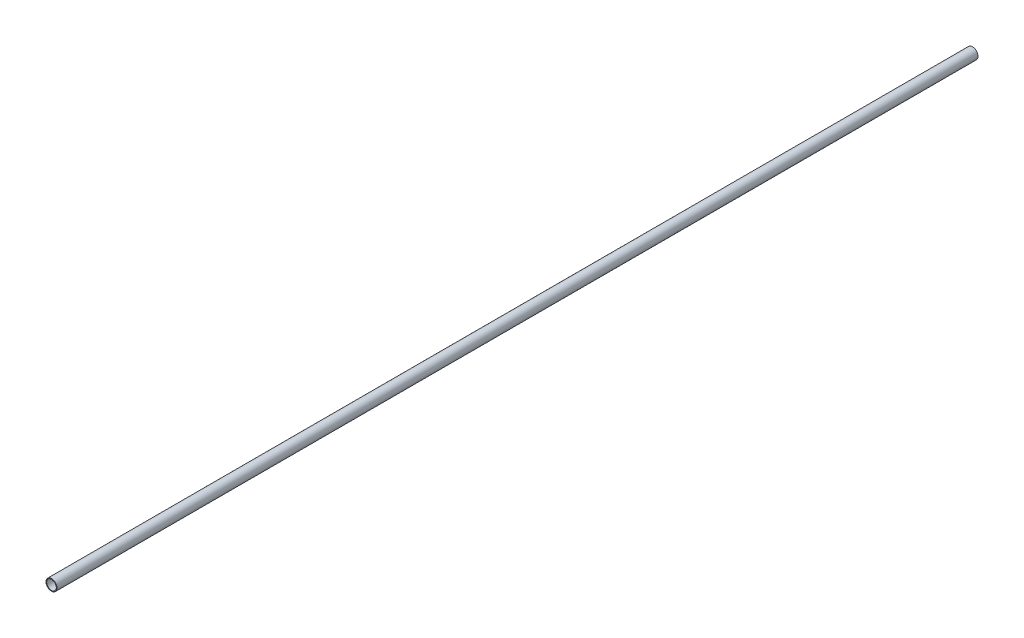
ISO-10303-21;
HEADER;
FILE_DESCRIPTION(('STEP AP214'),'2;1');
FILE_NAME('part.step','',(''),(''),'','','');
FILE_SCHEMA(('AUTOMOTIVE_DESIGN { 1 0 10303 214 1 1 1 1 }'));
ENDSEC;
DATA;
#1=APPLICATION_CONTEXT('core data for automotive mechanical design processes');
#2=APPLICATION_PROTOCOL_DEFINITION('international standard','automotive_design',2000,#1);
#3=PRODUCT_CONTEXT('',#1,'mechanical');
#4=PRODUCT('Part','Part','',(#3));
#5=PRODUCT_RELATED_PRODUCT_CATEGORY('part','',(#4));
#6=PRODUCT_DEFINITION_FORMATION('','',#4);
#7=PRODUCT_DEFINITION_CONTEXT('part definition',#1,'design');
#8=PRODUCT_DEFINITION('design','',#6,#7);
#9=PRODUCT_DEFINITION_SHAPE('','',#8);
#10=(LENGTH_UNIT() NAMED_UNIT(*) SI_UNIT(.MILLI.,.METRE.));
#11=(NAMED_UNIT(*) PLANE_ANGLE_UNIT() SI_UNIT($,.RADIAN.));
#12=(NAMED_UNIT(*) SI_UNIT($,.STERADIAN.) SOLID_ANGLE_UNIT());
#13=UNCERTAINTY_MEASURE_WITH_UNIT(LENGTH_MEASURE(1.E-05),#10,'distance_accuracy_value','');
#14=(GEOMETRIC_REPRESENTATION_CONTEXT(3) GLOBAL_UNCERTAINTY_ASSIGNED_CONTEXT((#13)) GLOBAL_UNIT_ASSIGNED_CONTEXT((#10,
#11,#12)) REPRESENTATION_CONTEXT('',''));
#15=CARTESIAN_POINT('',(0.,0.,0.));
#16=DIRECTION('',(0.,0.,1.));
#17=DIRECTION('',(1.,0.,0.));
#18=AXIS2_PLACEMENT_3D('',#15,#16,#17);
#19=CARTESIAN_POINT('',(0.,0.,914.4));
#20=DIRECTION('',(0.,0.,1.));
#21=DIRECTION('',(1.,0.,0.));
#22=AXIS2_PLACEMENT_3D('',#19,#20,#21);
#23=PLANE('',#22);
#24=CARTESIAN_POINT('',(0.,0.,914.4));
#25=DIRECTION('',(0.,0.,1.));
#26=DIRECTION('',(1.,0.,0.));
#27=AXIS2_PLACEMENT_3D('',#24,#25,#26);
#28=CIRCLE('',#27,10.922);
#29=CARTESIAN_POINT('',(10.922,0.,914.4));
#30=VERTEX_POINT('',#29);
#31=EDGE_CURVE('E10',#30,#30,#28,.T.);
#32=ORIENTED_EDGE('',*,*,#31,.T.);
#33=EDGE_LOOP('',(#32));
#34=FACE_BOUND('',#33,.T.);
#35=CARTESIAN_POINT('',(0.,0.,914.4));
#36=DIRECTION('',(0.,0.,1.));
#37=DIRECTION('',(1.,0.,0.));
#38=AXIS2_PLACEMENT_3D('',#35,#36,#37);
#39=CIRCLE('',#38,9.525);
#40=CARTESIAN_POINT('',(9.525,0.,914.4));
#41=VERTEX_POINT('',#40);
#42=EDGE_CURVE('E49',#41,#41,#39,.T.);
#43=ORIENTED_EDGE('',*,*,#42,.F.);
#44=EDGE_LOOP('',(#43));
#45=FACE_BOUND('',#44,.T.);
#46=ADVANCED_FACE('F41',(#34,#45),#23,.T.);
#47=CARTESIAN_POINT('',(0.,0.,914.4));
#48=DIRECTION('',(0.,0.,-1.));
#49=DIRECTION('',(-1.,0.,0.));
#50=AXIS2_PLACEMENT_3D('',#47,#48,#49);
#51=CYLINDRICAL_SURFACE('',#50,10.922);
#52=ORIENTED_EDGE('',*,*,#31,.F.);
#53=EDGE_LOOP('',(#52));
#54=FACE_BOUND('',#53,.T.);
#55=CARTESIAN_POINT('',(0.,0.,-914.4));
#56=DIRECTION('',(0.,0.,1.));
#57=DIRECTION('',(1.,0.,0.));
#58=AXIS2_PLACEMENT_3D('',#55,#56,#57);
#59=CIRCLE('',#58,10.922);
#60=CARTESIAN_POINT('',(10.922,0.,-914.4));
#61=VERTEX_POINT('',#60);
#62=EDGE_CURVE('E54',#61,#61,#59,.T.);
#63=ORIENTED_EDGE('',*,*,#62,.T.);
#64=EDGE_LOOP('',(#63));
#65=FACE_BOUND('',#64,.T.);
#66=ADVANCED_FACE('F43',(#54,#65),#51,.T.);
#67=CARTESIAN_POINT('',(0.,0.,914.4));
#68=DIRECTION('',(0.,0.,-1.));
#69=DIRECTION('',(-1.,0.,0.));
#70=AXIS2_PLACEMENT_3D('',#67,#68,#69);
#71=CYLINDRICAL_SURFACE('',#70,9.525);
#72=ORIENTED_EDGE('',*,*,#42,.T.);
#73=EDGE_LOOP('',(#72));
#74=FACE_BOUND('',#73,.T.);
#75=CARTESIAN_POINT('',(0.,0.,-914.4));
#76=DIRECTION('',(0.,0.,1.));
#77=DIRECTION('',(1.,0.,0.));
#78=AXIS2_PLACEMENT_3D('',#75,#76,#77);
#79=CIRCLE('',#78,9.525);
#80=CARTESIAN_POINT('',(9.525,0.,-914.4));
#81=VERTEX_POINT('',#80);
#82=EDGE_CURVE('E59',#81,#81,#79,.T.);
#83=ORIENTED_EDGE('',*,*,#82,.F.);
#84=EDGE_LOOP('',(#83));
#85=FACE_BOUND('',#84,.T.);
#86=ADVANCED_FACE('F69',(#74,#85),#71,.F.);
#87=CARTESIAN_POINT('',(0.,0.,-914.4));
#88=DIRECTION('',(0.,0.,1.));
#89=DIRECTION('',(1.,0.,0.));
#90=AXIS2_PLACEMENT_3D('',#87,#88,#89);
#91=PLANE('',#90);
#92=ORIENTED_EDGE('',*,*,#82,.T.);
#93=EDGE_LOOP('',(#92));
#94=FACE_BOUND('',#93,.T.);
#95=ORIENTED_EDGE('',*,*,#62,.F.);
#96=EDGE_LOOP('',(#95));
#97=FACE_BOUND('',#96,.T.);
#98=ADVANCED_FACE('F66',(#94,#97),#91,.F.);
#99=CLOSED_SHELL('',(#46,#66,#86,#98));
#100=MANIFOLD_SOLID_BREP('B2',#99);
#101=ADVANCED_BREP_SHAPE_REPRESENTATION('',(#18,#100),#14);
#102=SHAPE_DEFINITION_REPRESENTATION(#9,#101);
ENDSEC;
END-ISO-10303-21;
